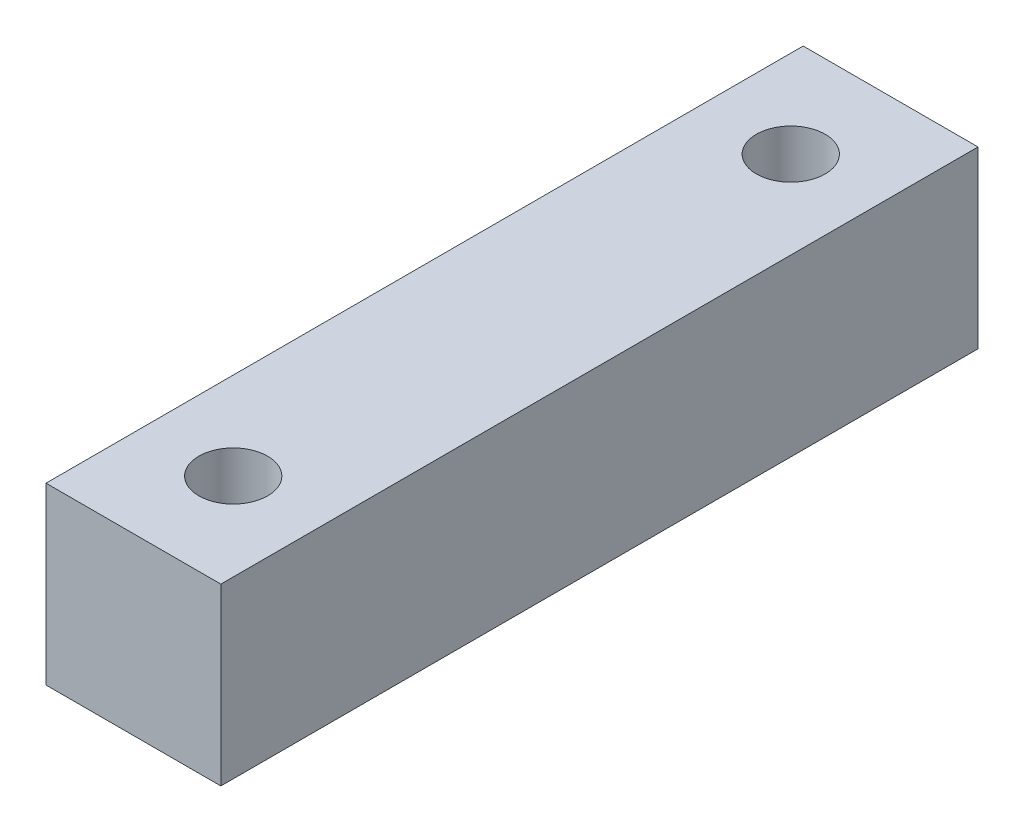
ISO-10303-21;
HEADER;
FILE_DESCRIPTION(('STEP AP214'),'2;1');
FILE_NAME('part.step','',(''),(''),'','','');
FILE_SCHEMA(('AUTOMOTIVE_DESIGN { 1 0 10303 214 1 1 1 1 }'));
ENDSEC;
DATA;
#1=APPLICATION_CONTEXT('core data for automotive mechanical design processes');
#2=APPLICATION_PROTOCOL_DEFINITION('international standard','automotive_design',2000,#1);
#3=PRODUCT_CONTEXT('',#1,'mechanical');
#4=PRODUCT('Part','Part','',(#3));
#5=PRODUCT_RELATED_PRODUCT_CATEGORY('part','',(#4));
#6=PRODUCT_DEFINITION_FORMATION('','',#4);
#7=PRODUCT_DEFINITION_CONTEXT('part definition',#1,'design');
#8=PRODUCT_DEFINITION('design','',#6,#7);
#9=PRODUCT_DEFINITION_SHAPE('','',#8);
#10=(LENGTH_UNIT() NAMED_UNIT(*) SI_UNIT(.MILLI.,.METRE.));
#11=(NAMED_UNIT(*) PLANE_ANGLE_UNIT() SI_UNIT($,.RADIAN.));
#12=(NAMED_UNIT(*) SI_UNIT($,.STERADIAN.) SOLID_ANGLE_UNIT());
#13=UNCERTAINTY_MEASURE_WITH_UNIT(LENGTH_MEASURE(1.E-05),#10,'distance_accuracy_value','');
#14=(GEOMETRIC_REPRESENTATION_CONTEXT(3) GLOBAL_UNCERTAINTY_ASSIGNED_CONTEXT((#13)) GLOBAL_UNIT_ASSIGNED_CONTEXT((#10,
#11,#12)) REPRESENTATION_CONTEXT('',''));
#15=CARTESIAN_POINT('',(0.,0.,0.));
#16=DIRECTION('',(0.,0.,1.));
#17=DIRECTION('',(1.,0.,0.));
#18=AXIS2_PLACEMENT_3D('',#15,#16,#17);
#19=CARTESIAN_POINT('',(0.,12.7,0.));
#20=DIRECTION('',(0.,-1.,0.));
#21=DIRECTION('',(0.,0.,-1.));
#22=AXIS2_PLACEMENT_3D('',#19,#20,#21);
#23=PLANE('',#22);
#24=DIRECTION('',(1.,0.,0.));
#25=VECTOR('',#24,1.);
#26=CARTESIAN_POINT('',(12.7,12.7,0.));
#27=LINE('',#26,#25);
#28=CARTESIAN_POINT('',(0.,12.7,0.));
#29=VERTEX_POINT('',#28);
#30=CARTESIAN_POINT('',(12.7,12.7,0.));
#31=VERTEX_POINT('',#30);
#32=EDGE_CURVE('E88',#29,#31,#27,.T.);
#33=ORIENTED_EDGE('',*,*,#32,.T.);
#34=DIRECTION('',(0.,0.,-1.));
#35=VECTOR('',#34,1.);
#36=CARTESIAN_POINT('',(12.7,12.7,-55.));
#37=LINE('',#36,#35);
#38=CARTESIAN_POINT('',(12.7,12.7,-55.));
#39=VERTEX_POINT('',#38);
#40=EDGE_CURVE('E83',#31,#39,#37,.T.);
#41=ORIENTED_EDGE('',*,*,#40,.T.);
#42=DIRECTION('',(-1.,0.,0.));
#43=VECTOR('',#42,1.);
#44=CARTESIAN_POINT('',(0.,12.7,-55.));
#45=LINE('',#44,#43);
#46=CARTESIAN_POINT('',(0.,12.7,-55.));
#47=VERTEX_POINT('',#46);
#48=EDGE_CURVE('E86',#39,#47,#45,.T.);
#49=ORIENTED_EDGE('',*,*,#48,.T.);
#50=DIRECTION('',(0.,0.,1.));
#51=VECTOR('',#50,1.);
#52=CARTESIAN_POINT('',(0.,12.7,0.));
#53=LINE('',#52,#51);
#54=EDGE_CURVE('E53',#47,#29,#53,.T.);
#55=ORIENTED_EDGE('',*,*,#54,.T.);
#56=EDGE_LOOP('',(#33,#41,#49,#55));
#57=FACE_BOUND('',#56,.T.);
#58=CARTESIAN_POINT('',(6.35000000000001,12.7,-7.25));
#59=DIRECTION('',(0.,1.,0.));
#60=DIRECTION('',(0.,0.,1.));
#61=AXIS2_PLACEMENT_3D('',#58,#59,#60);
#62=CIRCLE('',#61,2.5);
#63=CARTESIAN_POINT('',(6.35000000000001,12.7,-4.75));
#64=VERTEX_POINT('',#63);
#65=EDGE_CURVE('E103',#64,#64,#62,.T.);
#66=ORIENTED_EDGE('',*,*,#65,.F.);
#67=EDGE_LOOP('',(#66));
#68=FACE_BOUND('',#67,.T.);
#69=CARTESIAN_POINT('',(6.35000000000001,12.7,-47.75));
#70=DIRECTION('',(0.,1.,0.));
#71=DIRECTION('',(0.,0.,1.));
#72=AXIS2_PLACEMENT_3D('',#69,#70,#71);
#73=CIRCLE('',#72,2.5);
#74=CARTESIAN_POINT('',(6.35000000000001,12.7,-45.25));
#75=VERTEX_POINT('',#74);
#76=EDGE_CURVE('E118',#75,#75,#73,.T.);
#77=ORIENTED_EDGE('',*,*,#76,.F.);
#78=EDGE_LOOP('',(#77));
#79=FACE_BOUND('',#78,.T.);
#80=ADVANCED_FACE('F36',(#57,#68,#79),#23,.F.);
#81=CARTESIAN_POINT('',(0.,0.,0.));
#82=DIRECTION('',(0.,-1.,0.));
#83=DIRECTION('',(0.,0.,-1.));
#84=AXIS2_PLACEMENT_3D('',#81,#82,#83);
#85=PLANE('',#84);
#86=CARTESIAN_POINT('',(6.35000000000001,0.,-7.25));
#87=DIRECTION('',(0.,1.,0.));
#88=DIRECTION('',(0.,0.,1.));
#89=AXIS2_PLACEMENT_3D('',#86,#87,#88);
#90=CIRCLE('',#89,2.5);
#91=CARTESIAN_POINT('',(6.35000000000001,0.,-4.75));
#92=VERTEX_POINT('',#91);
#93=EDGE_CURVE('E115',#92,#92,#90,.T.);
#94=ORIENTED_EDGE('',*,*,#93,.T.);
#95=EDGE_LOOP('',(#94));
#96=FACE_BOUND('',#95,.T.);
#97=DIRECTION('',(1.,0.,0.));
#98=VECTOR('',#97,1.);
#99=CARTESIAN_POINT('',(12.7,0.,0.));
#100=LINE('',#99,#98);
#101=CARTESIAN_POINT('',(0.,0.,0.));
#102=VERTEX_POINT('',#101);
#103=CARTESIAN_POINT('',(12.7,0.,0.));
#104=VERTEX_POINT('',#103);
#105=EDGE_CURVE('E100',#102,#104,#100,.T.);
#106=ORIENTED_EDGE('',*,*,#105,.F.);
#107=DIRECTION('',(0.,0.,1.));
#108=VECTOR('',#107,1.);
#109=CARTESIAN_POINT('',(0.,0.,0.));
#110=LINE('',#109,#108);
#111=CARTESIAN_POINT('',(0.,0.,-55.));
#112=VERTEX_POINT('',#111);
#113=EDGE_CURVE('E76',#112,#102,#110,.T.);
#114=ORIENTED_EDGE('',*,*,#113,.F.);
#115=DIRECTION('',(-1.,0.,0.));
#116=VECTOR('',#115,1.);
#117=CARTESIAN_POINT('',(0.,0.,-55.));
#118=LINE('',#117,#116);
#119=CARTESIAN_POINT('',(12.7,0.,-55.));
#120=VERTEX_POINT('',#119);
#121=EDGE_CURVE('E70',#120,#112,#118,.T.);
#122=ORIENTED_EDGE('',*,*,#121,.F.);
#123=DIRECTION('',(0.,0.,-1.));
#124=VECTOR('',#123,1.);
#125=CARTESIAN_POINT('',(12.7,0.,-55.));
#126=LINE('',#125,#124);
#127=EDGE_CURVE('E92',#104,#120,#126,.T.);
#128=ORIENTED_EDGE('',*,*,#127,.F.);
#129=EDGE_LOOP('',(#106,#114,#122,#128));
#130=FACE_BOUND('',#129,.T.);
#131=CARTESIAN_POINT('',(6.35000000000001,0.,-47.75));
#132=DIRECTION('',(0.,1.,0.));
#133=DIRECTION('',(0.,0.,1.));
#134=AXIS2_PLACEMENT_3D('',#131,#132,#133);
#135=CIRCLE('',#134,2.5);
#136=CARTESIAN_POINT('',(6.35000000000001,0.,-45.25));
#137=VERTEX_POINT('',#136);
#138=EDGE_CURVE('E121',#137,#137,#135,.T.);
#139=ORIENTED_EDGE('',*,*,#138,.T.);
#140=EDGE_LOOP('',(#139));
#141=FACE_BOUND('',#140,.T.);
#142=ADVANCED_FACE('F111',(#96,#130,#141),#85,.T.);
#143=CARTESIAN_POINT('',(12.7,12.7,0.));
#144=DIRECTION('',(0.,0.,-1.));
#145=DIRECTION('',(-1.,0.,0.));
#146=AXIS2_PLACEMENT_3D('',#143,#144,#145);
#147=PLANE('',#146);
#148=ORIENTED_EDGE('',*,*,#105,.T.);
#149=DIRECTION('',(0.,-1.,0.));
#150=VECTOR('',#149,1.);
#151=CARTESIAN_POINT('',(12.7,12.7,0.));
#152=LINE('',#151,#150);
#153=EDGE_CURVE('E11',#31,#104,#152,.T.);
#154=ORIENTED_EDGE('',*,*,#153,.F.);
#155=ORIENTED_EDGE('',*,*,#32,.F.);
#156=DIRECTION('',(0.,-1.,0.));
#157=VECTOR('',#156,1.);
#158=CARTESIAN_POINT('',(0.,12.7,0.));
#159=LINE('',#158,#157);
#160=EDGE_CURVE('E96',#29,#102,#159,.T.);
#161=ORIENTED_EDGE('',*,*,#160,.T.);
#162=EDGE_LOOP('',(#148,#154,#155,#161));
#163=FACE_BOUND('',#162,.T.);
#164=ADVANCED_FACE('F38',(#163),#147,.F.);
#165=CARTESIAN_POINT('',(12.7,12.7,-55.));
#166=DIRECTION('',(-1.,0.,0.));
#167=DIRECTION('',(0.,0.,1.));
#168=AXIS2_PLACEMENT_3D('',#165,#166,#167);
#169=PLANE('',#168);
#170=ORIENTED_EDGE('',*,*,#127,.T.);
#171=DIRECTION('',(0.,-1.,0.));
#172=VECTOR('',#171,1.);
#173=CARTESIAN_POINT('',(12.7,12.7,-55.));
#174=LINE('',#173,#172);
#175=EDGE_CURVE('E45',#39,#120,#174,.T.);
#176=ORIENTED_EDGE('',*,*,#175,.F.);
#177=ORIENTED_EDGE('',*,*,#40,.F.);
#178=ORIENTED_EDGE('',*,*,#153,.T.);
#179=EDGE_LOOP('',(#170,#176,#177,#178));
#180=FACE_BOUND('',#179,.T.);
#181=ADVANCED_FACE('F91',(#180),#169,.F.);
#182=CARTESIAN_POINT('',(0.,12.7,-55.));
#183=DIRECTION('',(0.,0.,1.));
#184=DIRECTION('',(1.,0.,0.));
#185=AXIS2_PLACEMENT_3D('',#182,#183,#184);
#186=PLANE('',#185);
#187=ORIENTED_EDGE('',*,*,#121,.T.);
#188=DIRECTION('',(0.,-1.,0.));
#189=VECTOR('',#188,1.);
#190=CARTESIAN_POINT('',(0.,12.7,-55.));
#191=LINE('',#190,#189);
#192=EDGE_CURVE('E93',#47,#112,#191,.T.);
#193=ORIENTED_EDGE('',*,*,#192,.F.);
#194=ORIENTED_EDGE('',*,*,#48,.F.);
#195=ORIENTED_EDGE('',*,*,#175,.T.);
#196=EDGE_LOOP('',(#187,#193,#194,#195));
#197=FACE_BOUND('',#196,.T.);
#198=ADVANCED_FACE('F94',(#197),#186,.F.);
#199=CARTESIAN_POINT('',(0.,12.7,0.));
#200=DIRECTION('',(1.,0.,0.));
#201=DIRECTION('',(0.,0.,-1.));
#202=AXIS2_PLACEMENT_3D('',#199,#200,#201);
#203=PLANE('',#202);
#204=ORIENTED_EDGE('',*,*,#113,.T.);
#205=ORIENTED_EDGE('',*,*,#160,.F.);
#206=ORIENTED_EDGE('',*,*,#54,.F.);
#207=ORIENTED_EDGE('',*,*,#192,.T.);
#208=EDGE_LOOP('',(#204,#205,#206,#207));
#209=FACE_BOUND('',#208,.T.);
#210=ADVANCED_FACE('F108',(#209),#203,.F.);
#211=CARTESIAN_POINT('',(6.35000000000001,12.7,-7.25));
#212=DIRECTION('',(0.,-1.,0.));
#213=DIRECTION('',(0.,0.,-1.));
#214=AXIS2_PLACEMENT_3D('',#211,#212,#213);
#215=CYLINDRICAL_SURFACE('',#214,2.5);
#216=ORIENTED_EDGE('',*,*,#65,.T.);
#217=EDGE_LOOP('',(#216));
#218=FACE_BOUND('',#217,.T.);
#219=ORIENTED_EDGE('',*,*,#93,.F.);
#220=EDGE_LOOP('',(#219));
#221=FACE_BOUND('',#220,.T.);
#222=ADVANCED_FACE('F138',(#218,#221),#215,.F.);
#223=CARTESIAN_POINT('',(6.35000000000001,12.7,-47.75));
#224=DIRECTION('',(0.,-1.,0.));
#225=DIRECTION('',(0.,0.,-1.));
#226=AXIS2_PLACEMENT_3D('',#223,#224,#225);
#227=CYLINDRICAL_SURFACE('',#226,2.5);
#228=ORIENTED_EDGE('',*,*,#76,.T.);
#229=EDGE_LOOP('',(#228));
#230=FACE_BOUND('',#229,.T.);
#231=ORIENTED_EDGE('',*,*,#138,.F.);
#232=EDGE_LOOP('',(#231));
#233=FACE_BOUND('',#232,.T.);
#234=ADVANCED_FACE('F127',(#230,#233),#227,.F.);
#235=CLOSED_SHELL('',(#80,#142,#164,#181,#198,#210,#222,#234));
#236=MANIFOLD_SOLID_BREP('B2',#235);
#237=ADVANCED_BREP_SHAPE_REPRESENTATION('',(#18,#236),#14);
#238=SHAPE_DEFINITION_REPRESENTATION(#9,#237);
ENDSEC;
END-ISO-10303-21;
